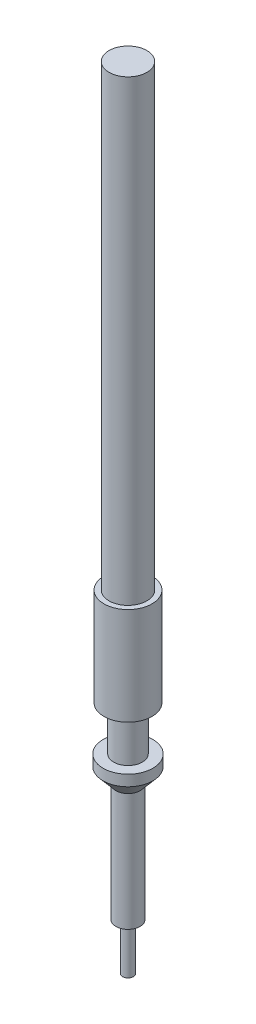
ISO-10303-21;
HEADER;
FILE_DESCRIPTION(('STEP AP214'),'2;1');
FILE_NAME('part.step','',(''),(''),'','','');
FILE_SCHEMA(('AUTOMOTIVE_DESIGN { 1 0 10303 214 1 1 1 1 }'));
ENDSEC;
DATA;
#1=APPLICATION_CONTEXT('core data for automotive mechanical design processes');
#2=APPLICATION_PROTOCOL_DEFINITION('international standard','automotive_design',2000,#1);
#3=PRODUCT_CONTEXT('',#1,'mechanical');
#4=PRODUCT('Part','Part','',(#3));
#5=PRODUCT_RELATED_PRODUCT_CATEGORY('part','',(#4));
#6=PRODUCT_DEFINITION_FORMATION('','',#4);
#7=PRODUCT_DEFINITION_CONTEXT('part definition',#1,'design');
#8=PRODUCT_DEFINITION('design','',#6,#7);
#9=PRODUCT_DEFINITION_SHAPE('','',#8);
#10=(LENGTH_UNIT() NAMED_UNIT(*) SI_UNIT(.MILLI.,.METRE.));
#11=(NAMED_UNIT(*) PLANE_ANGLE_UNIT() SI_UNIT($,.RADIAN.));
#12=(NAMED_UNIT(*) SI_UNIT($,.STERADIAN.) SOLID_ANGLE_UNIT());
#13=UNCERTAINTY_MEASURE_WITH_UNIT(LENGTH_MEASURE(1.E-05),#10,'distance_accuracy_value','');
#14=(GEOMETRIC_REPRESENTATION_CONTEXT(3) GLOBAL_UNCERTAINTY_ASSIGNED_CONTEXT((#13)) GLOBAL_UNIT_ASSIGNED_CONTEXT((#10,
#11,#12)) REPRESENTATION_CONTEXT('',''));
#15=CARTESIAN_POINT('',(0.,0.,0.));
#16=DIRECTION('',(0.,0.,1.));
#17=DIRECTION('',(1.,0.,0.));
#18=AXIS2_PLACEMENT_3D('',#15,#16,#17);
#19=CARTESIAN_POINT('',(-0.109680025687998,78.9114993645574,10.109680025688));
#20=DIRECTION('',(0.,-1.,0.));
#21=DIRECTION('',(0.,0.,-1.));
#22=AXIS2_PLACEMENT_3D('',#19,#20,#21);
#23=PLANE('',#22);
#24=CARTESIAN_POINT('',(0.,78.9114993645574,10.));
#25=DIRECTION('',(0.,1.,0.));
#26=DIRECTION('',(0.,0.,1.));
#27=AXIS2_PLACEMENT_3D('',#24,#25,#26);
#28=CIRCLE('',#27,0.108379472015999);
#29=CARTESIAN_POINT('',(0.,78.9114993645574,10.108379472016));
#30=VERTEX_POINT('',#29);
#31=EDGE_CURVE('E36',#30,#30,#28,.F.);
#32=ORIENTED_EDGE('',*,*,#31,.T.);
#33=EDGE_LOOP('',(#32));
#34=FACE_BOUND('',#33,.T.);
#35=ADVANCED_FACE('F32',(#34),#23,.T.);
#36=CARTESIAN_POINT('',(0.,78.9114993645574,10.));
#37=DIRECTION('',(0.,1.,0.));
#38=DIRECTION('',(0.,0.,1.));
#39=AXIS2_PLACEMENT_3D('',#36,#37,#38);
#40=CYLINDRICAL_SURFACE('',#39,0.108379472015999);
#41=ORIENTED_EDGE('',*,*,#31,.F.);
#42=EDGE_LOOP('',(#41));
#43=FACE_BOUND('',#42,.T.);
#44=CARTESIAN_POINT('',(0.,79.8577346856414,10.));
#45=DIRECTION('',(0.,1.,0.));
#46=DIRECTION('',(0.,0.,1.));
#47=AXIS2_PLACEMENT_3D('',#44,#45,#46);
#48=CIRCLE('',#47,0.108379472015999);
#49=CARTESIAN_POINT('',(0.,79.8577346856414,10.108379472016));
#50=VERTEX_POINT('',#49);
#51=EDGE_CURVE('E68',#50,#50,#48,.T.);
#52=ORIENTED_EDGE('',*,*,#51,.F.);
#53=EDGE_LOOP('',(#52));
#54=FACE_BOUND('',#53,.T.);
#55=ADVANCED_FACE('F76',(#43,#54),#40,.T.);
#56=CARTESIAN_POINT('',(-0.246517336775998,79.8577346856414,10.246517336776));
#57=DIRECTION('',(0.,-1.,0.));
#58=DIRECTION('',(0.,0.,-1.));
#59=AXIS2_PLACEMENT_3D('',#56,#57,#58);
#60=PLANE('',#59);
#61=ORIENTED_EDGE('',*,*,#51,.T.);
#62=EDGE_LOOP('',(#61));
#63=FACE_BOUND('',#62,.T.);
#64=CARTESIAN_POINT('',(0.,79.8577346856414,10.));
#65=DIRECTION('',(0.,1.,0.));
#66=DIRECTION('',(-1.,0.,0.));
#67=AXIS2_PLACEMENT_3D('',#64,#65,#66);
#68=CIRCLE('',#67,0.243594206284);
#69=CARTESIAN_POINT('',(-0.243594206283998,79.8577346856414,10.));
#70=VERTEX_POINT('',#69);
#71=EDGE_CURVE('E66',#70,#70,#68,.F.);
#72=ORIENTED_EDGE('',*,*,#71,.T.);
#73=EDGE_LOOP('',(#72));
#74=FACE_BOUND('',#73,.T.);
#75=ADVANCED_FACE('F79',(#63,#74),#60,.T.);
#76=CARTESIAN_POINT('',(0.,79.8577346856414,10.));
#77=DIRECTION('',(0.,1.,0.));
#78=DIRECTION('',(-1.,0.,0.));
#79=AXIS2_PLACEMENT_3D('',#76,#77,#78);
#80=CYLINDRICAL_SURFACE('',#79,0.243594206284);
#81=ORIENTED_EDGE('',*,*,#71,.F.);
#82=EDGE_LOOP('',(#81));
#83=FACE_BOUND('',#82,.T.);
#84=CARTESIAN_POINT('',(0.,82.2339921241774,10.));
#85=DIRECTION('',(0.,1.,0.));
#86=DIRECTION('',(0.,0.,1.));
#87=AXIS2_PLACEMENT_3D('',#84,#85,#86);
#88=CIRCLE('',#87,0.243594206284);
#89=CARTESIAN_POINT('',(0.,82.2339921241774,10.243594206284));
#90=VERTEX_POINT('',#89);
#91=EDGE_CURVE('E48',#90,#90,#88,.F.);
#92=ORIENTED_EDGE('',*,*,#91,.T.);
#93=EDGE_LOOP('',(#92));
#94=FACE_BOUND('',#93,.T.);
#95=ADVANCED_FACE('F85',(#83,#94),#80,.T.);
#96=CARTESIAN_POINT('',(0.,82.2339921241774,10.));
#97=DIRECTION('',(0.,1.,0.));
#98=DIRECTION('',(0.,0.,1.));
#99=AXIS2_PLACEMENT_3D('',#96,#97,#98);
#100=CONICAL_SURFACE('',#99,0.243594206284,0.709470737786859);
#101=ORIENTED_EDGE('',*,*,#91,.F.);
#102=EDGE_LOOP('',(#101));
#103=FACE_BOUND('',#102,.T.);
#104=CARTESIAN_POINT('',(0.,82.5363496224774,10.));
#105=DIRECTION('',(0.,1.,0.));
#106=DIRECTION('',(0.,0.,1.));
#107=AXIS2_PLACEMENT_3D('',#104,#105,#106);
#108=CIRCLE('',#107,0.503201017488001);
#109=CARTESIAN_POINT('',(0.,82.5363496224774,10.503201017488));
#110=VERTEX_POINT('',#109);
#111=EDGE_CURVE('E65',#110,#110,#108,.F.);
#112=ORIENTED_EDGE('',*,*,#111,.T.);
#113=EDGE_LOOP('',(#112));
#114=FACE_BOUND('',#113,.T.);
#115=ADVANCED_FACE('F113',(#103,#114),#100,.T.);
#116=CARTESIAN_POINT('',(0.,82.5363496224774,10.));
#117=DIRECTION('',(0.,1.,0.));
#118=DIRECTION('',(0.,0.,1.));
#119=AXIS2_PLACEMENT_3D('',#116,#117,#118);
#120=CYLINDRICAL_SURFACE('',#119,0.503201017488001);
#121=ORIENTED_EDGE('',*,*,#111,.F.);
#122=EDGE_LOOP('',(#121));
#123=FACE_BOUND('',#122,.T.);
#124=CARTESIAN_POINT('',(0.,82.7569007927934,10.));
#125=DIRECTION('',(0.,1.,0.));
#126=DIRECTION('',(0.,0.,1.));
#127=AXIS2_PLACEMENT_3D('',#124,#125,#126);
#128=CIRCLE('',#127,0.503201017488001);
#129=CARTESIAN_POINT('',(0.,82.7569007927934,10.503201017488));
#130=VERTEX_POINT('',#129);
#131=EDGE_CURVE('E62',#130,#130,#128,.T.);
#132=ORIENTED_EDGE('',*,*,#131,.F.);
#133=EDGE_LOOP('',(#132));
#134=FACE_BOUND('',#133,.T.);
#135=ADVANCED_FACE('F110',(#123,#134),#120,.T.);
#136=CARTESIAN_POINT('',(-0.509239429691998,82.7569007927934,9.490760570308));
#137=DIRECTION('',(0.,1.,0.));
#138=DIRECTION('',(0.,0.,1.));
#139=AXIS2_PLACEMENT_3D('',#136,#137,#138);
#140=PLANE('',#139);
#141=CARTESIAN_POINT('',(0.,82.7569007927934,10.));
#142=DIRECTION('',(0.,1.,0.));
#143=DIRECTION('',(0.,0.,1.));
#144=AXIS2_PLACEMENT_3D('',#141,#142,#143);
#145=CIRCLE('',#144,0.289704129708);
#146=CARTESIAN_POINT('',(0.,82.7569007927934,10.289704129708));
#147=VERTEX_POINT('',#146);
#148=EDGE_CURVE('E59',#147,#147,#145,.F.);
#149=ORIENTED_EDGE('',*,*,#148,.T.);
#150=EDGE_LOOP('',(#149));
#151=FACE_BOUND('',#150,.T.);
#152=ORIENTED_EDGE('',*,*,#131,.T.);
#153=EDGE_LOOP('',(#152));
#154=FACE_BOUND('',#153,.T.);
#155=ADVANCED_FACE('F108',(#151,#154),#140,.T.);
#156=CARTESIAN_POINT('',(0.,82.7569007927934,10.));
#157=DIRECTION('',(0.,1.,0.));
#158=DIRECTION('',(0.,0.,1.));
#159=AXIS2_PLACEMENT_3D('',#156,#157,#158);
#160=CYLINDRICAL_SURFACE('',#159,0.289704129708);
#161=ORIENTED_EDGE('',*,*,#148,.F.);
#162=EDGE_LOOP('',(#161));
#163=FACE_BOUND('',#162,.T.);
#164=CARTESIAN_POINT('',(0.,83.6533344018894,10.));
#165=DIRECTION('',(0.,1.,0.));
#166=DIRECTION('',(0.,0.,1.));
#167=AXIS2_PLACEMENT_3D('',#164,#165,#166);
#168=CIRCLE('',#167,0.289704129708);
#169=CARTESIAN_POINT('',(0.,83.6533344018894,10.289704129708));
#170=VERTEX_POINT('',#169);
#171=EDGE_CURVE('E56',#170,#170,#168,.T.);
#172=ORIENTED_EDGE('',*,*,#171,.F.);
#173=EDGE_LOOP('',(#172));
#174=FACE_BOUND('',#173,.T.);
#175=ADVANCED_FACE('F105',(#163,#174),#160,.T.);
#176=CARTESIAN_POINT('',(-0.491234567211998,83.6533344018894,10.491234567212));
#177=DIRECTION('',(0.,-1.,0.));
#178=DIRECTION('',(0.,0.,-1.));
#179=AXIS2_PLACEMENT_3D('',#176,#177,#178);
#180=PLANE('',#179);
#181=ORIENTED_EDGE('',*,*,#171,.T.);
#182=EDGE_LOOP('',(#181));
#183=FACE_BOUND('',#182,.T.);
#184=CARTESIAN_POINT('',(0.,83.6533344018894,10.));
#185=DIRECTION('',(0.,1.,0.));
#186=DIRECTION('',(0.,0.,1.));
#187=AXIS2_PLACEMENT_3D('',#184,#185,#186);
#188=CIRCLE('',#187,0.485409651348);
#189=CARTESIAN_POINT('',(0.,83.6533344018894,10.485409651348));
#190=VERTEX_POINT('',#189);
#191=EDGE_CURVE('E53',#190,#190,#188,.F.);
#192=ORIENTED_EDGE('',*,*,#191,.T.);
#193=EDGE_LOOP('',(#192));
#194=FACE_BOUND('',#193,.T.);
#195=ADVANCED_FACE('F103',(#183,#194),#180,.T.);
#196=CARTESIAN_POINT('',(0.,83.6533344018894,10.));
#197=DIRECTION('',(0.,1.,0.));
#198=DIRECTION('',(0.,0.,1.));
#199=AXIS2_PLACEMENT_3D('',#196,#197,#198);
#200=CYLINDRICAL_SURFACE('',#199,0.485409651348);
#201=ORIENTED_EDGE('',*,*,#191,.F.);
#202=EDGE_LOOP('',(#201));
#203=FACE_BOUND('',#202,.T.);
#204=CARTESIAN_POINT('',(0.,85.6245248847694,10.));
#205=DIRECTION('',(0.,1.,0.));
#206=DIRECTION('',(0.,0.,1.));
#207=AXIS2_PLACEMENT_3D('',#204,#205,#206);
#208=CIRCLE('',#207,0.485409651348);
#209=CARTESIAN_POINT('',(0.,85.6245248847694,10.485409651348));
#210=VERTEX_POINT('',#209);
#211=EDGE_CURVE('E45',#210,#210,#208,.T.);
#212=ORIENTED_EDGE('',*,*,#211,.F.);
#213=EDGE_LOOP('',(#212));
#214=FACE_BOUND('',#213,.T.);
#215=ADVANCED_FACE('F100',(#203,#214),#200,.T.);
#216=CARTESIAN_POINT('',(-0.386819381251998,94.8729927498254,9.613180618748));
#217=DIRECTION('',(0.,1.,0.));
#218=DIRECTION('',(0.,0.,1.));
#219=AXIS2_PLACEMENT_3D('',#216,#217,#218);
#220=PLANE('',#219);
#221=CARTESIAN_POINT('',(0.,94.8729927498254,10.));
#222=DIRECTION('',(0.,1.,0.));
#223=DIRECTION('',(0.,0.,1.));
#224=AXIS2_PLACEMENT_3D('',#221,#222,#223);
#225=CIRCLE('',#224,0.382232590196001);
#226=CARTESIAN_POINT('',(0.,94.8729927498254,10.382232590196));
#227=VERTEX_POINT('',#226);
#228=EDGE_CURVE('E40',#227,#227,#225,.T.);
#229=ORIENTED_EDGE('',*,*,#228,.T.);
#230=EDGE_LOOP('',(#229));
#231=FACE_BOUND('',#230,.T.);
#232=ADVANCED_FACE('F96',(#231),#220,.T.);
#233=CARTESIAN_POINT('',(-0.491234567211998,85.6245248847694,9.508765432788));
#234=DIRECTION('',(0.,1.,0.));
#235=DIRECTION('',(0.,0.,1.));
#236=AXIS2_PLACEMENT_3D('',#233,#234,#235);
#237=PLANE('',#236);
#238=CARTESIAN_POINT('',(0.,85.6245248847694,10.));
#239=DIRECTION('',(0.,1.,0.));
#240=DIRECTION('',(0.,0.,1.));
#241=AXIS2_PLACEMENT_3D('',#238,#239,#240);
#242=CIRCLE('',#241,0.382232590196001);
#243=CARTESIAN_POINT('',(0.,85.6245248847694,10.382232590196));
#244=VERTEX_POINT('',#243);
#245=EDGE_CURVE('E10',#244,#244,#242,.F.);
#246=ORIENTED_EDGE('',*,*,#245,.T.);
#247=EDGE_LOOP('',(#246));
#248=FACE_BOUND('',#247,.T.);
#249=ORIENTED_EDGE('',*,*,#211,.T.);
#250=EDGE_LOOP('',(#249));
#251=FACE_BOUND('',#250,.T.);
#252=ADVANCED_FACE('F34',(#248,#251),#237,.T.);
#253=CARTESIAN_POINT('',(0.,85.6245248847694,10.));
#254=DIRECTION('',(0.,1.,0.));
#255=DIRECTION('',(0.,0.,1.));
#256=AXIS2_PLACEMENT_3D('',#253,#254,#255);
#257=CYLINDRICAL_SURFACE('',#256,0.382232590196001);
#258=ORIENTED_EDGE('',*,*,#228,.F.);
#259=EDGE_LOOP('',(#258));
#260=FACE_BOUND('',#259,.T.);
#261=ORIENTED_EDGE('',*,*,#245,.F.);
#262=EDGE_LOOP('',(#261));
#263=FACE_BOUND('',#262,.T.);
#264=ADVANCED_FACE('F89',(#260,#263),#257,.T.);
#265=CLOSED_SHELL('',(#35,#55,#75,#95,#115,#135,#155,#175,#195,#215,#232,#252,#264));
#266=MANIFOLD_SOLID_BREP('B2',#265);
#267=ADVANCED_BREP_SHAPE_REPRESENTATION('',(#18,#266),#14);
#268=SHAPE_DEFINITION_REPRESENTATION(#9,#267);
ENDSEC;
END-ISO-10303-21;
